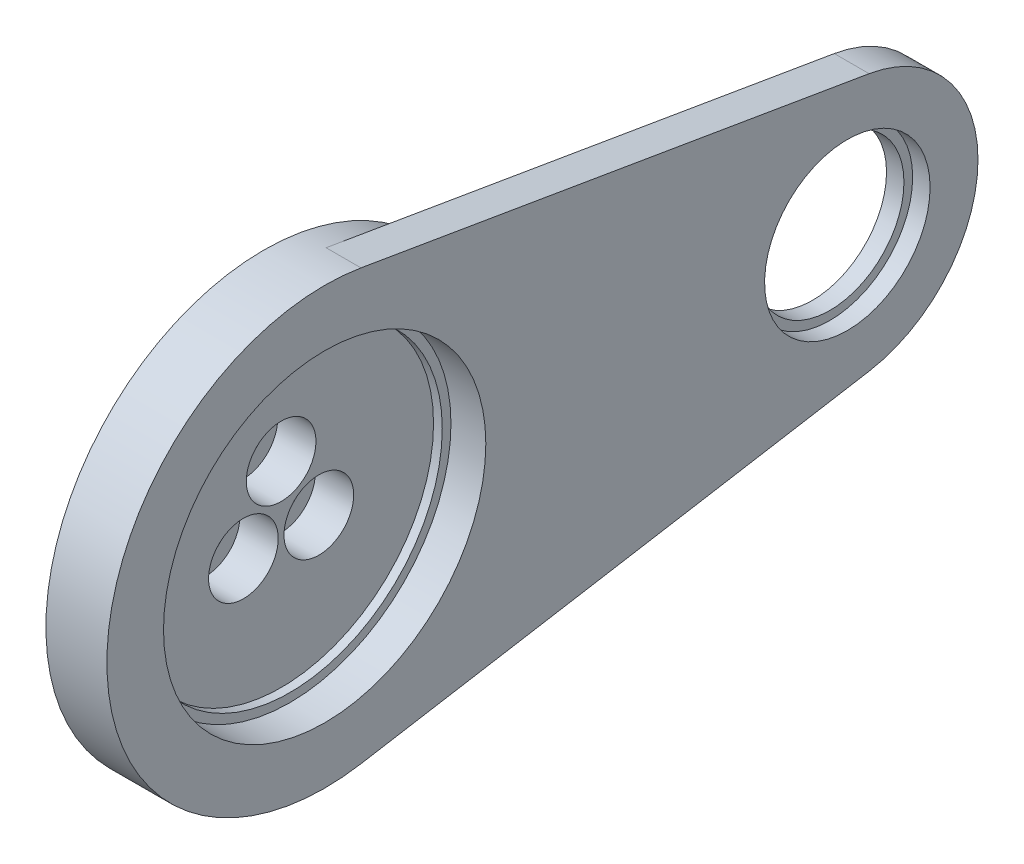
ISO-10303-21;
HEADER;
FILE_DESCRIPTION(('STEP AP214'),'2;1');
FILE_NAME('part.step','',(''),(''),'','','');
FILE_SCHEMA(('AUTOMOTIVE_DESIGN { 1 0 10303 214 1 1 1 1 }'));
ENDSEC;
DATA;
#1=APPLICATION_CONTEXT('core data for automotive mechanical design processes');
#2=APPLICATION_PROTOCOL_DEFINITION('international standard','automotive_design',2000,#1);
#3=PRODUCT_CONTEXT('',#1,'mechanical');
#4=PRODUCT('Part','Part','',(#3));
#5=PRODUCT_RELATED_PRODUCT_CATEGORY('part','',(#4));
#6=PRODUCT_DEFINITION_FORMATION('','',#4);
#7=PRODUCT_DEFINITION_CONTEXT('part definition',#1,'design');
#8=PRODUCT_DEFINITION('design','',#6,#7);
#9=PRODUCT_DEFINITION_SHAPE('','',#8);
#10=(LENGTH_UNIT() NAMED_UNIT(*) SI_UNIT(.MILLI.,.METRE.));
#11=(NAMED_UNIT(*) PLANE_ANGLE_UNIT() SI_UNIT($,.RADIAN.));
#12=(NAMED_UNIT(*) SI_UNIT($,.STERADIAN.) SOLID_ANGLE_UNIT());
#13=UNCERTAINTY_MEASURE_WITH_UNIT(LENGTH_MEASURE(1.E-05),#10,'distance_accuracy_value','');
#14=(GEOMETRIC_REPRESENTATION_CONTEXT(3) GLOBAL_UNCERTAINTY_ASSIGNED_CONTEXT((#13)) GLOBAL_UNIT_ASSIGNED_CONTEXT((#10,
#11,#12)) REPRESENTATION_CONTEXT('',''));
#15=CARTESIAN_POINT('',(0.,0.,0.));
#16=DIRECTION('',(0.,0.,1.));
#17=DIRECTION('',(1.,0.,0.));
#18=AXIS2_PLACEMENT_3D('',#15,#16,#17);
#19=CARTESIAN_POINT('',(-5.,0.,0.));
#20=DIRECTION('',(-1.,0.,0.));
#21=DIRECTION('',(0.,0.,1.));
#22=AXIS2_PLACEMENT_3D('',#19,#20,#21);
#23=PLANE('',#22);
#24=CARTESIAN_POINT('',(-5.,0.,0.));
#25=DIRECTION('',(-1.,0.,0.));
#26=DIRECTION('',(0.,0.,1.));
#27=AXIS2_PLACEMENT_3D('',#24,#25,#26);
#28=CIRCLE('',#27,9.5);
#29=CARTESIAN_POINT('',(-5.,0.,9.5));
#30=VERTEX_POINT('',#29);
#31=EDGE_CURVE('E141',#30,#30,#28,.T.);
#32=ORIENTED_EDGE('',*,*,#31,.T.);
#33=EDGE_LOOP('',(#32));
#34=FACE_BOUND('',#33,.T.);
#35=CARTESIAN_POINT('',(-5.00000000000001,5.,0.));
#36=DIRECTION('',(1.,0.,0.));
#37=DIRECTION('',(0.,0.,-1.));
#38=AXIS2_PLACEMENT_3D('',#35,#36,#37);
#39=CIRCLE('',#38,2.25000000000003);
#40=CARTESIAN_POINT('',(-5.00000000000001,5.,-2.25000000000003));
#41=VERTEX_POINT('',#40);
#42=EDGE_CURVE('E147',#41,#41,#39,.T.);
#43=ORIENTED_EDGE('',*,*,#42,.T.);
#44=EDGE_LOOP('',(#43));
#45=FACE_BOUND('',#44,.T.);
#46=CARTESIAN_POINT('',(-5.00000000000001,-2.50000000000002,4.33012701892218));
#47=DIRECTION('',(1.,0.,0.));
#48=DIRECTION('',(0.,0.,-1.));
#49=AXIS2_PLACEMENT_3D('',#46,#47,#48);
#50=CIRCLE('',#49,2.25000000000002);
#51=CARTESIAN_POINT('',(-5.00000000000001,-2.50000000000002,2.08012701892216));
#52=VERTEX_POINT('',#51);
#53=EDGE_CURVE('E201',#52,#52,#50,.T.);
#54=ORIENTED_EDGE('',*,*,#53,.T.);
#55=EDGE_LOOP('',(#54));
#56=FACE_BOUND('',#55,.T.);
#57=CARTESIAN_POINT('',(-5.00000000000001,-2.49999999999996,-4.33012701892222));
#58=DIRECTION('',(1.,0.,0.));
#59=DIRECTION('',(0.,0.,-1.));
#60=AXIS2_PLACEMENT_3D('',#57,#58,#59);
#61=CIRCLE('',#60,2.25000000000002);
#62=CARTESIAN_POINT('',(-5.00000000000001,-2.49999999999996,-6.58012701892224));
#63=VERTEX_POINT('',#62);
#64=EDGE_CURVE('E185',#63,#63,#61,.T.);
#65=ORIENTED_EDGE('',*,*,#64,.T.);
#66=EDGE_LOOP('',(#65));
#67=FACE_BOUND('',#66,.T.);
#68=ADVANCED_FACE('F38',(#34,#45,#56,#67),#23,.T.);
#69=CARTESIAN_POINT('',(-103.5,0.,-60.));
#70=DIRECTION('',(1.,0.,0.));
#71=DIRECTION('',(0.,0.,-1.));
#72=AXIS2_PLACEMENT_3D('',#69,#70,#71);
#73=CYLINDRICAL_SURFACE('',#72,8.5);
#74=CARTESIAN_POINT('',(3.,0.,-60.));
#75=DIRECTION('',(1.,0.,0.));
#76=DIRECTION('',(0.,0.,-1.));
#77=AXIS2_PLACEMENT_3D('',#74,#75,#76);
#78=CIRCLE('',#77,8.5);
#79=CARTESIAN_POINT('',(3.,0.,-68.5));
#80=VERTEX_POINT('',#79);
#81=EDGE_CURVE('E130',#80,#80,#78,.T.);
#82=ORIENTED_EDGE('',*,*,#81,.F.);
#83=EDGE_LOOP('',(#82));
#84=FACE_BOUND('',#83,.T.);
#85=CARTESIAN_POINT('',(5.,0.,-60.));
#86=DIRECTION('',(1.,0.,0.));
#87=DIRECTION('',(0.,0.,-1.));
#88=AXIS2_PLACEMENT_3D('',#85,#86,#87);
#89=CIRCLE('',#88,8.5);
#90=CARTESIAN_POINT('',(5.,0.,-68.5));
#91=VERTEX_POINT('',#90);
#92=EDGE_CURVE('E133',#91,#91,#89,.F.);
#93=ORIENTED_EDGE('',*,*,#92,.F.);
#94=EDGE_LOOP('',(#93));
#95=FACE_BOUND('',#94,.T.);
#96=ADVANCED_FACE('F259',(#84,#95),#73,.F.);
#97=CARTESIAN_POINT('',(3.,0.,0.));
#98=DIRECTION('',(1.,0.,0.));
#99=DIRECTION('',(0.,0.,-1.));
#100=AXIS2_PLACEMENT_3D('',#97,#98,#99);
#101=PLANE('',#100);
#102=CARTESIAN_POINT('',(3.,0.,0.));
#103=DIRECTION('',(1.,0.,0.));
#104=DIRECTION('',(0.,0.,-1.));
#105=AXIS2_PLACEMENT_3D('',#102,#103,#104);
#106=CIRCLE('',#105,17.5);
#107=CARTESIAN_POINT('',(3.,0.,-17.5));
#108=VERTEX_POINT('',#107);
#109=EDGE_CURVE('E119',#108,#108,#106,.T.);
#110=ORIENTED_EDGE('',*,*,#109,.F.);
#111=EDGE_LOOP('',(#110));
#112=FACE_BOUND('',#111,.T.);
#113=CARTESIAN_POINT('',(3.,0.,0.));
#114=DIRECTION('',(1.,0.,0.));
#115=DIRECTION('',(0.,0.,-1.));
#116=AXIS2_PLACEMENT_3D('',#113,#114,#115);
#117=CIRCLE('',#116,18.5);
#118=CARTESIAN_POINT('',(3.,0.,-18.5));
#119=VERTEX_POINT('',#118);
#120=EDGE_CURVE('E115',#119,#119,#117,.T.);
#121=ORIENTED_EDGE('',*,*,#120,.T.);
#122=EDGE_LOOP('',(#121));
#123=FACE_BOUND('',#122,.T.);
#124=ADVANCED_FACE('F253',(#112,#123),#101,.T.);
#125=CARTESIAN_POINT('',(3.,0.,0.));
#126=DIRECTION('',(-1.,0.,0.));
#127=DIRECTION('',(0.,0.,1.));
#128=AXIS2_PLACEMENT_3D('',#125,#126,#127);
#129=CYLINDRICAL_SURFACE('',#128,17.5);
#130=ORIENTED_EDGE('',*,*,#109,.T.);
#131=EDGE_LOOP('',(#130));
#132=FACE_BOUND('',#131,.T.);
#133=CARTESIAN_POINT('',(2.,0.,0.));
#134=DIRECTION('',(1.,0.,0.));
#135=DIRECTION('',(0.,0.,-1.));
#136=AXIS2_PLACEMENT_3D('',#133,#134,#135);
#137=CIRCLE('',#136,17.5);
#138=CARTESIAN_POINT('',(2.,0.,-17.5));
#139=VERTEX_POINT('',#138);
#140=EDGE_CURVE('E48',#139,#139,#137,.F.);
#141=ORIENTED_EDGE('',*,*,#140,.T.);
#142=EDGE_LOOP('',(#141));
#143=FACE_BOUND('',#142,.T.);
#144=ADVANCED_FACE('F247',(#132,#143),#129,.F.);
#145=CARTESIAN_POINT('',(2.,0.,0.));
#146=DIRECTION('',(1.,0.,0.));
#147=DIRECTION('',(0.,0.,-1.));
#148=AXIS2_PLACEMENT_3D('',#145,#146,#147);
#149=PLANE('',#148);
#150=CARTESIAN_POINT('',(2.,-2.49999999999996,-4.33012701892222));
#151=DIRECTION('',(1.,0.,0.));
#152=DIRECTION('',(0.,0.,-1.));
#153=AXIS2_PLACEMENT_3D('',#150,#151,#152);
#154=CIRCLE('',#153,4.);
#155=CARTESIAN_POINT('',(2.,-2.49999999999996,-8.33012701892222));
#156=VERTEX_POINT('',#155);
#157=EDGE_CURVE('E170',#156,#156,#154,.T.);
#158=ORIENTED_EDGE('',*,*,#157,.F.);
#159=EDGE_LOOP('',(#158));
#160=FACE_BOUND('',#159,.T.);
#161=CARTESIAN_POINT('',(2.,-2.50000000000002,4.33012701892218));
#162=DIRECTION('',(1.,0.,0.));
#163=DIRECTION('',(0.,0.,-1.));
#164=AXIS2_PLACEMENT_3D('',#161,#162,#163);
#165=CIRCLE('',#164,4.);
#166=CARTESIAN_POINT('',(2.,-2.50000000000002,0.330127018922183));
#167=VERTEX_POINT('',#166);
#168=EDGE_CURVE('E189',#167,#167,#165,.T.);
#169=ORIENTED_EDGE('',*,*,#168,.F.);
#170=EDGE_LOOP('',(#169));
#171=FACE_BOUND('',#170,.T.);
#172=CARTESIAN_POINT('',(2.,5.,0.));
#173=DIRECTION('',(1.,0.,0.));
#174=DIRECTION('',(0.,0.,-1.));
#175=AXIS2_PLACEMENT_3D('',#172,#173,#174);
#176=CIRCLE('',#175,4.);
#177=CARTESIAN_POINT('',(2.,5.,-4.));
#178=VERTEX_POINT('',#177);
#179=EDGE_CURVE('E205',#178,#178,#176,.T.);
#180=ORIENTED_EDGE('',*,*,#179,.F.);
#181=EDGE_LOOP('',(#180));
#182=FACE_BOUND('',#181,.T.);
#183=ORIENTED_EDGE('',*,*,#140,.F.);
#184=EDGE_LOOP('',(#183));
#185=FACE_BOUND('',#184,.T.);
#186=ADVANCED_FACE('F243',(#160,#171,#182,#185),#149,.T.);
#187=CARTESIAN_POINT('',(10.,0.,0.));
#188=DIRECTION('',(-1.,0.,0.));
#189=DIRECTION('',(0.,0.,1.));
#190=AXIS2_PLACEMENT_3D('',#187,#188,#189);
#191=CYLINDRICAL_SURFACE('',#190,18.5);
#192=CARTESIAN_POINT('',(7.,0.,0.));
#193=DIRECTION('',(-1.,0.,0.));
#194=DIRECTION('',(0.,-1.,0.));
#195=AXIS2_PLACEMENT_3D('',#192,#193,#194);
#196=CIRCLE('',#195,18.5);
#197=CARTESIAN_POINT('',(7.00000000000001,-18.5,0.));
#198=VERTEX_POINT('',#197);
#199=EDGE_CURVE('E165',#198,#198,#196,.T.);
#200=ORIENTED_EDGE('',*,*,#199,.F.);
#201=EDGE_LOOP('',(#200));
#202=FACE_BOUND('',#201,.T.);
#203=ORIENTED_EDGE('',*,*,#120,.F.);
#204=EDGE_LOOP('',(#203));
#205=FACE_BOUND('',#204,.T.);
#206=ADVANCED_FACE('F246',(#202,#205),#191,.F.);
#207=CARTESIAN_POINT('',(0.,0.,0.));
#208=DIRECTION('',(1.,0.,0.));
#209=DIRECTION('',(0.,0.,-1.));
#210=AXIS2_PLACEMENT_3D('',#207,#208,#209);
#211=PLANE('',#210);
#212=CARTESIAN_POINT('',(0.,0.,0.));
#213=DIRECTION('',(-1.,0.,0.));
#214=DIRECTION('',(0.,0.,1.));
#215=AXIS2_PLACEMENT_3D('',#212,#213,#214);
#216=CIRCLE('',#215,9.5);
#217=CARTESIAN_POINT('',(0.,0.,9.5));
#218=VERTEX_POINT('',#217);
#219=EDGE_CURVE('E11',#218,#218,#216,.T.);
#220=ORIENTED_EDGE('',*,*,#219,.F.);
#221=EDGE_LOOP('',(#220));
#222=FACE_BOUND('',#221,.T.);
#223=CARTESIAN_POINT('',(0.,0.,0.));
#224=DIRECTION('',(1.,0.,0.));
#225=DIRECTION('',(0.,0.,-1.));
#226=AXIS2_PLACEMENT_3D('',#223,#224,#225);
#227=CIRCLE('',#226,25.);
#228=CARTESIAN_POINT('',(0.,0.,-25.));
#229=VERTEX_POINT('',#228);
#230=EDGE_CURVE('E123',#229,#229,#227,.T.);
#231=ORIENTED_EDGE('',*,*,#230,.F.);
#232=EDGE_LOOP('',(#231));
#233=FACE_BOUND('',#232,.T.);
#234=ADVANCED_FACE('F292',(#222,#233),#211,.F.);
#235=CARTESIAN_POINT('',(2.,0.,0.));
#236=DIRECTION('',(-1.,0.,0.));
#237=DIRECTION('',(0.,0.,1.));
#238=AXIS2_PLACEMENT_3D('',#235,#236,#237);
#239=CYLINDRICAL_SURFACE('',#238,25.);
#240=ORIENTED_EDGE('',*,*,#230,.T.);
#241=EDGE_LOOP('',(#240));
#242=FACE_BOUND('',#241,.T.);
#243=DIRECTION('',(1.,0.,0.));
#244=VECTOR('',#243,1.);
#245=CARTESIAN_POINT('',(3.,-24.6503324295817,-4.16666666666667));
#246=LINE('',#245,#244);
#247=CARTESIAN_POINT('',(3.,-24.6503324295817,-4.16666666666667));
#248=VERTEX_POINT('',#247);
#249=CARTESIAN_POINT('',(7.00000000000001,-24.6503324295817,-4.16666666666667));
#250=VERTEX_POINT('',#249);
#251=EDGE_CURVE('E105',#248,#250,#246,.T.);
#252=ORIENTED_EDGE('',*,*,#251,.T.);
#253=CARTESIAN_POINT('',(7.,0.,0.));
#254=DIRECTION('',(-1.,0.,0.));
#255=DIRECTION('',(0.,-1.,0.));
#256=AXIS2_PLACEMENT_3D('',#253,#254,#255);
#257=CIRCLE('',#256,25.);
#258=CARTESIAN_POINT('',(7.,24.6503324295817,-4.16666666666667));
#259=VERTEX_POINT('',#258);
#260=EDGE_CURVE('E56',#250,#259,#257,.T.);
#261=ORIENTED_EDGE('',*,*,#260,.T.);
#262=DIRECTION('',(1.,0.,0.));
#263=VECTOR('',#262,1.);
#264=CARTESIAN_POINT('',(3.,24.6503324295817,-4.16666666666667));
#265=LINE('',#264,#263);
#266=CARTESIAN_POINT('',(3.,24.6503324295817,-4.16666666666667));
#267=VERTEX_POINT('',#266);
#268=EDGE_CURVE('E109',#267,#259,#265,.T.);
#269=ORIENTED_EDGE('',*,*,#268,.F.);
#270=CARTESIAN_POINT('',(3.,0.,0.));
#271=DIRECTION('',(-1.,0.,0.));
#272=DIRECTION('',(0.,0.,-1.));
#273=AXIS2_PLACEMENT_3D('',#270,#271,#272);
#274=CIRCLE('',#273,25.);
#275=EDGE_CURVE('E64',#267,#248,#274,.T.);
#276=ORIENTED_EDGE('',*,*,#275,.T.);
#277=EDGE_LOOP('',(#252,#261,#269,#276));
#278=FACE_BOUND('',#277,.T.);
#279=ADVANCED_FACE('F40',(#242,#278),#239,.T.);
#280=CARTESIAN_POINT('',(3.,24.6503324295817,-4.16666666666667));
#281=DIRECTION('',(0.,0.986013297183269,-0.166666666666667));
#282=DIRECTION('',(0.,0.166666666666667,0.986013297183269));
#283=AXIS2_PLACEMENT_3D('',#280,#281,#282);
#284=PLANE('',#283);
#285=DIRECTION('',(0.,0.166666666666667,0.986013297183269));
#286=VECTOR('',#285,1.);
#287=CARTESIAN_POINT('',(7.,24.6503324295817,-4.16666666666667));
#288=LINE('',#287,#286);
#289=CARTESIAN_POINT('',(7.,14.790199457749,-62.5));
#290=VERTEX_POINT('',#289);
#291=EDGE_CURVE('E99',#290,#259,#288,.T.);
#292=ORIENTED_EDGE('',*,*,#291,.F.);
#293=DIRECTION('',(1.,0.,0.));
#294=VECTOR('',#293,1.);
#295=CARTESIAN_POINT('',(3.,14.790199457749,-62.5));
#296=LINE('',#295,#294);
#297=CARTESIAN_POINT('',(3.,14.790199457749,-62.5));
#298=VERTEX_POINT('',#297);
#299=EDGE_CURVE('E97',#298,#290,#296,.T.);
#300=ORIENTED_EDGE('',*,*,#299,.F.);
#301=DIRECTION('',(0.,0.166666666666667,0.986013297183269));
#302=VECTOR('',#301,1.);
#303=CARTESIAN_POINT('',(3.,24.6503324295817,-4.16666666666667));
#304=LINE('',#303,#302);
#305=EDGE_CURVE('E111',#298,#267,#304,.T.);
#306=ORIENTED_EDGE('',*,*,#305,.T.);
#307=ORIENTED_EDGE('',*,*,#268,.T.);
#308=EDGE_LOOP('',(#292,#300,#306,#307));
#309=FACE_BOUND('',#308,.T.);
#310=ADVANCED_FACE('F162',(#309),#284,.T.);
#311=CARTESIAN_POINT('',(3.,0.,-60.));
#312=DIRECTION('',(1.,0.,0.));
#313=DIRECTION('',(0.,0.,-1.));
#314=AXIS2_PLACEMENT_3D('',#311,#312,#313);
#315=CYLINDRICAL_SURFACE('',#314,15.);
#316=CARTESIAN_POINT('',(7.,0.,-60.));
#317=DIRECTION('',(-1.,0.,0.));
#318=DIRECTION('',(0.,-1.,0.));
#319=AXIS2_PLACEMENT_3D('',#316,#317,#318);
#320=CIRCLE('',#319,15.);
#321=CARTESIAN_POINT('',(7.00000000000001,-14.790199457749,-62.5));
#322=VERTEX_POINT('',#321);
#323=EDGE_CURVE('E84',#322,#290,#320,.F.);
#324=ORIENTED_EDGE('',*,*,#323,.F.);
#325=DIRECTION('',(1.,0.,0.));
#326=VECTOR('',#325,1.);
#327=CARTESIAN_POINT('',(3.,-14.790199457749,-62.5));
#328=LINE('',#327,#326);
#329=CARTESIAN_POINT('',(3.,-14.790199457749,-62.5));
#330=VERTEX_POINT('',#329);
#331=EDGE_CURVE('E95',#330,#322,#328,.T.);
#332=ORIENTED_EDGE('',*,*,#331,.F.);
#333=CARTESIAN_POINT('',(3.,0.,-60.));
#334=DIRECTION('',(1.,0.,0.));
#335=DIRECTION('',(0.,0.,-1.));
#336=AXIS2_PLACEMENT_3D('',#333,#334,#335);
#337=CIRCLE('',#336,15.);
#338=EDGE_CURVE('E154',#330,#298,#337,.T.);
#339=ORIENTED_EDGE('',*,*,#338,.T.);
#340=ORIENTED_EDGE('',*,*,#299,.T.);
#341=EDGE_LOOP('',(#324,#332,#339,#340));
#342=FACE_BOUND('',#341,.T.);
#343=ADVANCED_FACE('F93',(#342),#315,.T.);
#344=CARTESIAN_POINT('',(3.,-24.6503324295817,-4.16666666666667));
#345=DIRECTION('',(0.,-0.986013297183269,-0.166666666666667));
#346=DIRECTION('',(0.,0.166666666666667,-0.986013297183269));
#347=AXIS2_PLACEMENT_3D('',#344,#345,#346);
#348=PLANE('',#347);
#349=DIRECTION('',(0.,0.166666666666667,-0.986013297183269));
#350=VECTOR('',#349,1.);
#351=CARTESIAN_POINT('',(7.00000000000001,-24.6503324295817,-4.16666666666667));
#352=LINE('',#351,#350);
#353=EDGE_CURVE('E81',#250,#322,#352,.T.);
#354=ORIENTED_EDGE('',*,*,#353,.F.);
#355=ORIENTED_EDGE('',*,*,#251,.F.);
#356=DIRECTION('',(0.,0.166666666666667,-0.986013297183269));
#357=VECTOR('',#356,1.);
#358=CARTESIAN_POINT('',(3.,-24.6503324295817,-4.16666666666667));
#359=LINE('',#358,#357);
#360=EDGE_CURVE('E103',#248,#330,#359,.T.);
#361=ORIENTED_EDGE('',*,*,#360,.T.);
#362=ORIENTED_EDGE('',*,*,#331,.T.);
#363=EDGE_LOOP('',(#354,#355,#361,#362));
#364=FACE_BOUND('',#363,.T.);
#365=ADVANCED_FACE('F102',(#364),#348,.T.);
#366=CARTESIAN_POINT('',(3.,0.,0.));
#367=DIRECTION('',(1.,0.,0.));
#368=DIRECTION('',(0.,0.,-1.));
#369=AXIS2_PLACEMENT_3D('',#366,#367,#368);
#370=PLANE('',#369);
#371=ORIENTED_EDGE('',*,*,#81,.T.);
#372=EDGE_LOOP('',(#371));
#373=FACE_BOUND('',#372,.T.);
#374=ORIENTED_EDGE('',*,*,#275,.F.);
#375=ORIENTED_EDGE('',*,*,#305,.F.);
#376=ORIENTED_EDGE('',*,*,#338,.F.);
#377=ORIENTED_EDGE('',*,*,#360,.F.);
#378=EDGE_LOOP('',(#374,#375,#376,#377));
#379=FACE_BOUND('',#378,.T.);
#380=ADVANCED_FACE('F279',(#373,#379),#370,.F.);
#381=CARTESIAN_POINT('',(5.,0.,-60.));
#382=DIRECTION('',(1.,0.,0.));
#383=DIRECTION('',(0.,0.,-1.));
#384=AXIS2_PLACEMENT_3D('',#381,#382,#383);
#385=PLANE('',#384);
#386=CARTESIAN_POINT('',(5.,0.,-60.));
#387=DIRECTION('',(1.,0.,0.));
#388=DIRECTION('',(0.,0.,-1.));
#389=AXIS2_PLACEMENT_3D('',#386,#387,#388);
#390=CIRCLE('',#389,9.49999999999999);
#391=CARTESIAN_POINT('',(5.,0.,-69.5));
#392=VERTEX_POINT('',#391);
#393=EDGE_CURVE('E136',#392,#392,#390,.T.);
#394=ORIENTED_EDGE('',*,*,#393,.T.);
#395=EDGE_LOOP('',(#394));
#396=FACE_BOUND('',#395,.T.);
#397=ORIENTED_EDGE('',*,*,#92,.T.);
#398=EDGE_LOOP('',(#397));
#399=FACE_BOUND('',#398,.T.);
#400=ADVANCED_FACE('F276',(#396,#399),#385,.T.);
#401=CARTESIAN_POINT('',(5.,0.,-60.));
#402=DIRECTION('',(1.,0.,0.));
#403=DIRECTION('',(0.,0.,-1.));
#404=AXIS2_PLACEMENT_3D('',#401,#402,#403);
#405=CYLINDRICAL_SURFACE('',#404,9.49999999999999);
#406=CARTESIAN_POINT('',(7.,0.,-60.));
#407=DIRECTION('',(-1.,0.,0.));
#408=DIRECTION('',(0.,-1.,0.));
#409=AXIS2_PLACEMENT_3D('',#406,#407,#408);
#410=CIRCLE('',#409,9.49999999999999);
#411=CARTESIAN_POINT('',(7.00000000000001,-9.49999999999999,-60.));
#412=VERTEX_POINT('',#411);
#413=EDGE_CURVE('E42',#412,#412,#410,.F.);
#414=ORIENTED_EDGE('',*,*,#413,.T.);
#415=EDGE_LOOP('',(#414));
#416=FACE_BOUND('',#415,.T.);
#417=ORIENTED_EDGE('',*,*,#393,.F.);
#418=EDGE_LOOP('',(#417));
#419=FACE_BOUND('',#418,.T.);
#420=ADVANCED_FACE('F274',(#416,#419),#405,.F.);
#421=CARTESIAN_POINT('',(-5.,0.,0.));
#422=DIRECTION('',(1.,0.,0.));
#423=DIRECTION('',(0.,0.,-1.));
#424=AXIS2_PLACEMENT_3D('',#421,#422,#423);
#425=CYLINDRICAL_SURFACE('',#424,9.5);
#426=ORIENTED_EDGE('',*,*,#31,.F.);
#427=EDGE_LOOP('',(#426));
#428=FACE_BOUND('',#427,.T.);
#429=ORIENTED_EDGE('',*,*,#219,.T.);
#430=EDGE_LOOP('',(#429));
#431=FACE_BOUND('',#430,.T.);
#432=ADVANCED_FACE('F227',(#428,#431),#425,.T.);
#433=CARTESIAN_POINT('',(2.,5.,0.));
#434=DIRECTION('',(1.,0.,0.));
#435=DIRECTION('',(0.,0.,-1.));
#436=AXIS2_PLACEMENT_3D('',#433,#434,#435);
#437=CYLINDRICAL_SURFACE('',#436,2.25000000000003);
#438=ORIENTED_EDGE('',*,*,#42,.F.);
#439=EDGE_LOOP('',(#438));
#440=FACE_BOUND('',#439,.T.);
#441=CARTESIAN_POINT('',(-2.4,5.,0.));
#442=DIRECTION('',(1.,0.,0.));
#443=DIRECTION('',(0.,0.,-1.));
#444=AXIS2_PLACEMENT_3D('',#441,#442,#443);
#445=CIRCLE('',#444,2.25000000000003);
#446=CARTESIAN_POINT('',(-2.4,5.,-2.25000000000003));
#447=VERTEX_POINT('',#446);
#448=EDGE_CURVE('E213',#447,#447,#445,.T.);
#449=ORIENTED_EDGE('',*,*,#448,.T.);
#450=EDGE_LOOP('',(#449));
#451=FACE_BOUND('',#450,.T.);
#452=ADVANCED_FACE('F223',(#440,#451),#437,.F.);
#453=CARTESIAN_POINT('',(-2.4,7.25000000000003,0.));
#454=DIRECTION('',(-1.,0.,0.));
#455=DIRECTION('',(0.,0.,1.));
#456=AXIS2_PLACEMENT_3D('',#453,#454,#455);
#457=PLANE('',#456);
#458=ORIENTED_EDGE('',*,*,#448,.F.);
#459=EDGE_LOOP('',(#458));
#460=FACE_BOUND('',#459,.T.);
#461=CARTESIAN_POINT('',(-2.4,5.,0.));
#462=DIRECTION('',(1.,0.,0.));
#463=DIRECTION('',(0.,0.,-1.));
#464=AXIS2_PLACEMENT_3D('',#461,#462,#463);
#465=CIRCLE('',#464,4.);
#466=CARTESIAN_POINT('',(-2.4,5.,-4.));
#467=VERTEX_POINT('',#466);
#468=EDGE_CURVE('E209',#467,#467,#465,.T.);
#469=ORIENTED_EDGE('',*,*,#468,.T.);
#470=EDGE_LOOP('',(#469));
#471=FACE_BOUND('',#470,.T.);
#472=ADVANCED_FACE('F226',(#460,#471),#457,.F.);
#473=CARTESIAN_POINT('',(2.,5.,0.));
#474=DIRECTION('',(1.,0.,0.));
#475=DIRECTION('',(0.,0.,-1.));
#476=AXIS2_PLACEMENT_3D('',#473,#474,#475);
#477=CYLINDRICAL_SURFACE('',#476,4.);
#478=ORIENTED_EDGE('',*,*,#468,.F.);
#479=EDGE_LOOP('',(#478));
#480=FACE_BOUND('',#479,.T.);
#481=ORIENTED_EDGE('',*,*,#179,.T.);
#482=EDGE_LOOP('',(#481));
#483=FACE_BOUND('',#482,.T.);
#484=ADVANCED_FACE('F233',(#480,#483),#477,.F.);
#485=CARTESIAN_POINT('',(2.,-2.50000000000002,4.33012701892218));
#486=DIRECTION('',(1.,0.,0.));
#487=DIRECTION('',(0.,0.,-1.));
#488=AXIS2_PLACEMENT_3D('',#485,#486,#487);
#489=CYLINDRICAL_SURFACE('',#488,2.25000000000003);
#490=ORIENTED_EDGE('',*,*,#53,.F.);
#491=EDGE_LOOP('',(#490));
#492=FACE_BOUND('',#491,.T.);
#493=CARTESIAN_POINT('',(-2.4,-2.50000000000002,4.33012701892218));
#494=DIRECTION('',(1.,0.,0.));
#495=DIRECTION('',(0.,0.,-1.));
#496=AXIS2_PLACEMENT_3D('',#493,#494,#495);
#497=CIRCLE('',#496,2.25000000000003);
#498=CARTESIAN_POINT('',(-2.4,-2.50000000000002,2.08012701892216));
#499=VERTEX_POINT('',#498);
#500=EDGE_CURVE('E197',#499,#499,#497,.T.);
#501=ORIENTED_EDGE('',*,*,#500,.T.);
#502=EDGE_LOOP('',(#501));
#503=FACE_BOUND('',#502,.T.);
#504=ADVANCED_FACE('F239',(#492,#503),#489,.F.);
#505=CARTESIAN_POINT('',(-2.4,-0.249999999999995,4.33012701892218));
#506=DIRECTION('',(-1.,0.,0.));
#507=DIRECTION('',(0.,0.,1.));
#508=AXIS2_PLACEMENT_3D('',#505,#506,#507);
#509=PLANE('',#508);
#510=ORIENTED_EDGE('',*,*,#500,.F.);
#511=EDGE_LOOP('',(#510));
#512=FACE_BOUND('',#511,.T.);
#513=CARTESIAN_POINT('',(-2.4,-2.50000000000002,4.33012701892218));
#514=DIRECTION('',(1.,0.,0.));
#515=DIRECTION('',(0.,0.,-1.));
#516=AXIS2_PLACEMENT_3D('',#513,#514,#515);
#517=CIRCLE('',#516,4.);
#518=CARTESIAN_POINT('',(-2.4,-2.50000000000002,0.330127018922184));
#519=VERTEX_POINT('',#518);
#520=EDGE_CURVE('E193',#519,#519,#517,.T.);
#521=ORIENTED_EDGE('',*,*,#520,.T.);
#522=EDGE_LOOP('',(#521));
#523=FACE_BOUND('',#522,.T.);
#524=ADVANCED_FACE('F330',(#512,#523),#509,.F.);
#525=CARTESIAN_POINT('',(2.,-2.50000000000002,4.33012701892218));
#526=DIRECTION('',(1.,0.,0.));
#527=DIRECTION('',(0.,0.,-1.));
#528=AXIS2_PLACEMENT_3D('',#525,#526,#527);
#529=CYLINDRICAL_SURFACE('',#528,4.);
#530=ORIENTED_EDGE('',*,*,#520,.F.);
#531=EDGE_LOOP('',(#530));
#532=FACE_BOUND('',#531,.T.);
#533=ORIENTED_EDGE('',*,*,#168,.T.);
#534=EDGE_LOOP('',(#533));
#535=FACE_BOUND('',#534,.T.);
#536=ADVANCED_FACE('F326',(#532,#535),#529,.F.);
#537=CARTESIAN_POINT('',(2.,-2.49999999999996,-4.33012701892222));
#538=DIRECTION('',(1.,0.,0.));
#539=DIRECTION('',(0.,0.,-1.));
#540=AXIS2_PLACEMENT_3D('',#537,#538,#539);
#541=CYLINDRICAL_SURFACE('',#540,2.25000000000003);
#542=ORIENTED_EDGE('',*,*,#64,.F.);
#543=EDGE_LOOP('',(#542));
#544=FACE_BOUND('',#543,.T.);
#545=CARTESIAN_POINT('',(-2.4,-2.49999999999996,-4.33012701892222));
#546=DIRECTION('',(1.,0.,0.));
#547=DIRECTION('',(0.,0.,-1.));
#548=AXIS2_PLACEMENT_3D('',#545,#546,#547);
#549=CIRCLE('',#548,2.25000000000003);
#550=CARTESIAN_POINT('',(-2.4,-2.49999999999996,-6.58012701892224));
#551=VERTEX_POINT('',#550);
#552=EDGE_CURVE('E181',#551,#551,#549,.T.);
#553=ORIENTED_EDGE('',*,*,#552,.T.);
#554=EDGE_LOOP('',(#553));
#555=FACE_BOUND('',#554,.T.);
#556=ADVANCED_FACE('F322',(#544,#555),#541,.F.);
#557=CARTESIAN_POINT('',(-2.4,-0.249999999999934,-4.33012701892222));
#558=DIRECTION('',(-1.,0.,0.));
#559=DIRECTION('',(0.,0.,1.));
#560=AXIS2_PLACEMENT_3D('',#557,#558,#559);
#561=PLANE('',#560);
#562=ORIENTED_EDGE('',*,*,#552,.F.);
#563=EDGE_LOOP('',(#562));
#564=FACE_BOUND('',#563,.T.);
#565=CARTESIAN_POINT('',(-2.4,-2.49999999999996,-4.33012701892222));
#566=DIRECTION('',(1.,0.,0.));
#567=DIRECTION('',(0.,0.,-1.));
#568=AXIS2_PLACEMENT_3D('',#565,#566,#567);
#569=CIRCLE('',#568,4.);
#570=CARTESIAN_POINT('',(-2.4,-2.49999999999996,-8.33012701892222));
#571=VERTEX_POINT('',#570);
#572=EDGE_CURVE('E177',#571,#571,#569,.T.);
#573=ORIENTED_EDGE('',*,*,#572,.T.);
#574=EDGE_LOOP('',(#573));
#575=FACE_BOUND('',#574,.T.);
#576=ADVANCED_FACE('F316',(#564,#575),#561,.F.);
#577=CARTESIAN_POINT('',(2.,-2.49999999999996,-4.33012701892222));
#578=DIRECTION('',(1.,0.,0.));
#579=DIRECTION('',(0.,0.,-1.));
#580=AXIS2_PLACEMENT_3D('',#577,#578,#579);
#581=CYLINDRICAL_SURFACE('',#580,4.);
#582=ORIENTED_EDGE('',*,*,#572,.F.);
#583=EDGE_LOOP('',(#582));
#584=FACE_BOUND('',#583,.T.);
#585=ORIENTED_EDGE('',*,*,#157,.T.);
#586=EDGE_LOOP('',(#585));
#587=FACE_BOUND('',#586,.T.);
#588=ADVANCED_FACE('F307',(#584,#587),#581,.F.);
#589=CARTESIAN_POINT('',(7.,30.4496579795355,-1111.));
#590=DIRECTION('',(-1.,0.,0.));
#591=DIRECTION('',(0.,-1.,0.));
#592=AXIS2_PLACEMENT_3D('',#589,#590,#591);
#593=PLANE('',#592);
#594=ORIENTED_EDGE('',*,*,#199,.T.);
#595=EDGE_LOOP('',(#594));
#596=FACE_BOUND('',#595,.T.);
#597=ORIENTED_EDGE('',*,*,#413,.F.);
#598=EDGE_LOOP('',(#597));
#599=FACE_BOUND('',#598,.T.);
#600=ORIENTED_EDGE('',*,*,#353,.T.);
#601=ORIENTED_EDGE('',*,*,#323,.T.);
#602=ORIENTED_EDGE('',*,*,#291,.T.);
#603=ORIENTED_EDGE('',*,*,#260,.F.);
#604=EDGE_LOOP('',(#600,#601,#602,#603));
#605=FACE_BOUND('',#604,.T.);
#606=ADVANCED_FACE('F83',(#596,#599,#605),#593,.F.);
#607=CLOSED_SHELL('',(#68,#96,#124,#144,#186,#206,#234,#279,#310,#343,#365,#380,#400,#420,#432,
#452,#472,#484,#504,#524,#536,#556,#576,#588,#606));
#608=MANIFOLD_SOLID_BREP('B2',#607);
#609=ADVANCED_BREP_SHAPE_REPRESENTATION('',(#18,#608),#14);
#610=SHAPE_DEFINITION_REPRESENTATION(#9,#609);
ENDSEC;
END-ISO-10303-21;
